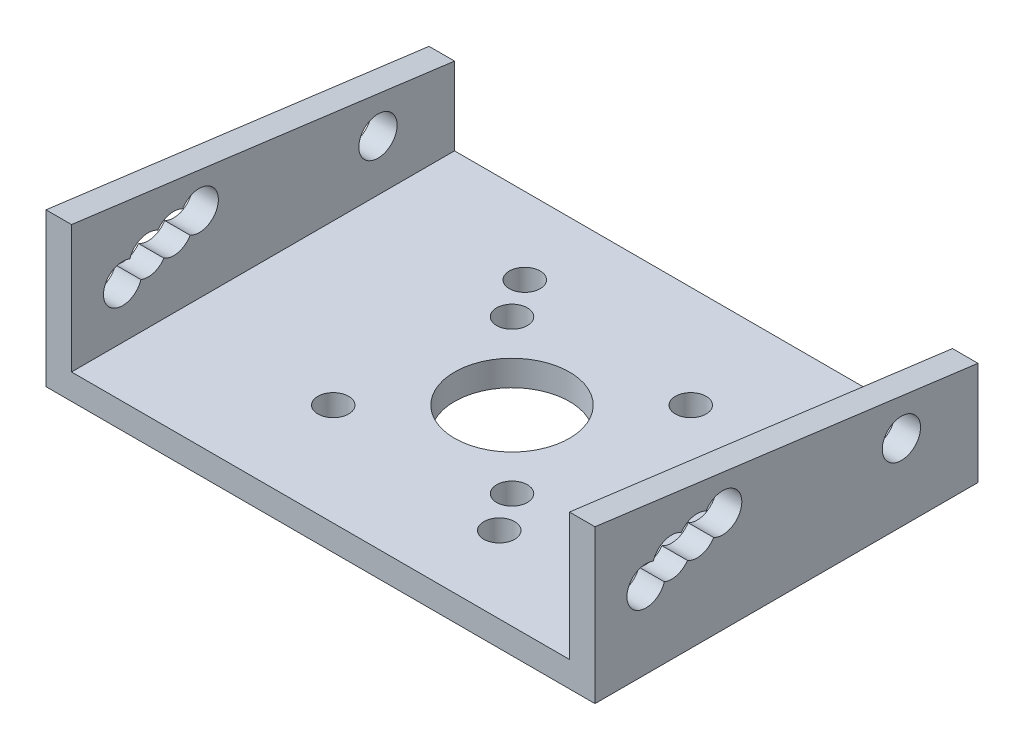
ISO-10303-21;
HEADER;
FILE_DESCRIPTION(('STEP AP214'),'2;1');
FILE_NAME('part.step','',(''),(''),'','','');
FILE_SCHEMA(('AUTOMOTIVE_DESIGN { 1 0 10303 214 1 1 1 1 }'));
ENDSEC;
DATA;
#1=APPLICATION_CONTEXT('core data for automotive mechanical design processes');
#2=APPLICATION_PROTOCOL_DEFINITION('international standard','automotive_design',2000,#1);
#3=PRODUCT_CONTEXT('',#1,'mechanical');
#4=PRODUCT('Part','Part','',(#3));
#5=PRODUCT_RELATED_PRODUCT_CATEGORY('part','',(#4));
#6=PRODUCT_DEFINITION_FORMATION('','',#4);
#7=PRODUCT_DEFINITION_CONTEXT('part definition',#1,'design');
#8=PRODUCT_DEFINITION('design','',#6,#7);
#9=PRODUCT_DEFINITION_SHAPE('','',#8);
#10=(LENGTH_UNIT() NAMED_UNIT(*) SI_UNIT(.MILLI.,.METRE.));
#11=(NAMED_UNIT(*) PLANE_ANGLE_UNIT() SI_UNIT($,.RADIAN.));
#12=(NAMED_UNIT(*) SI_UNIT($,.STERADIAN.) SOLID_ANGLE_UNIT());
#13=UNCERTAINTY_MEASURE_WITH_UNIT(LENGTH_MEASURE(1.E-05),#10,'distance_accuracy_value','');
#14=(GEOMETRIC_REPRESENTATION_CONTEXT(3) GLOBAL_UNCERTAINTY_ASSIGNED_CONTEXT((#13)) GLOBAL_UNIT_ASSIGNED_CONTEXT((#10,
#11,#12)) REPRESENTATION_CONTEXT('',''));
#15=CARTESIAN_POINT('',(0.,0.,0.));
#16=DIRECTION('',(0.,0.,1.));
#17=DIRECTION('',(1.,0.,0.));
#18=AXIS2_PLACEMENT_3D('',#15,#16,#17);
#19=CARTESIAN_POINT('',(0.,2.,0.));
#20=DIRECTION('',(0.,-1.,0.));
#21=DIRECTION('',(0.,0.,-1.));
#22=AXIS2_PLACEMENT_3D('',#19,#20,#21);
#23=PLANE('',#22);
#24=CARTESIAN_POINT('',(6.,2.,6.));
#25=DIRECTION('',(0.,1.,0.));
#26=DIRECTION('',(0.,0.,1.));
#27=AXIS2_PLACEMENT_3D('',#24,#25,#26);
#28=CIRCLE('',#27,1.2058376326813);
#29=CARTESIAN_POINT('',(6.,2.,7.2058376326813));
#30=VERTEX_POINT('',#29);
#31=EDGE_CURVE('E312',#30,#30,#28,.T.);
#32=ORIENTED_EDGE('',*,*,#31,.F.);
#33=EDGE_LOOP('',(#32));
#34=FACE_BOUND('',#33,.T.);
#35=CARTESIAN_POINT('',(-8.,2.,-9.));
#36=DIRECTION('',(0.,1.,0.));
#37=DIRECTION('',(0.,0.,1.));
#38=AXIS2_PLACEMENT_3D('',#35,#36,#37);
#39=CIRCLE('',#38,1.2058376326813);
#40=CARTESIAN_POINT('',(-8.,2.,-7.79416236731869));
#41=VERTEX_POINT('',#40);
#42=EDGE_CURVE('E324',#41,#41,#39,.T.);
#43=ORIENTED_EDGE('',*,*,#42,.F.);
#44=EDGE_LOOP('',(#43));
#45=FACE_BOUND('',#44,.T.);
#46=CARTESIAN_POINT('',(7.,2.,-7.));
#47=DIRECTION('',(0.,1.,0.));
#48=DIRECTION('',(0.,0.,1.));
#49=AXIS2_PLACEMENT_3D('',#46,#47,#48);
#50=CIRCLE('',#49,1.20583763268131);
#51=CARTESIAN_POINT('',(7.,2.,-5.79416236731869));
#52=VERTEX_POINT('',#51);
#53=EDGE_CURVE('E336',#52,#52,#50,.T.);
#54=ORIENTED_EDGE('',*,*,#53,.F.);
#55=EDGE_LOOP('',(#54));
#56=FACE_BOUND('',#55,.T.);
#57=CARTESIAN_POINT('',(0.,2.,0.));
#58=DIRECTION('',(0.,1.,0.));
#59=DIRECTION('',(0.,0.,1.));
#60=AXIS2_PLACEMENT_3D('',#57,#58,#59);
#61=CIRCLE('',#60,4.5);
#62=CARTESIAN_POINT('',(0.,2.,4.5));
#63=VERTEX_POINT('',#62);
#64=EDGE_CURVE('E342',#63,#63,#61,.T.);
#65=ORIENTED_EDGE('',*,*,#64,.F.);
#66=EDGE_LOOP('',(#65));
#67=FACE_BOUND('',#66,.T.);
#68=CARTESIAN_POINT('',(-6.,2.,-6.));
#69=DIRECTION('',(0.,1.,0.));
#70=DIRECTION('',(0.,0.,1.));
#71=AXIS2_PLACEMENT_3D('',#68,#69,#70);
#72=CIRCLE('',#71,1.2058376326813);
#73=CARTESIAN_POINT('',(-6.,2.,-4.7941623673187));
#74=VERTEX_POINT('',#73);
#75=EDGE_CURVE('E330',#74,#74,#72,.T.);
#76=ORIENTED_EDGE('',*,*,#75,.F.);
#77=EDGE_LOOP('',(#76));
#78=FACE_BOUND('',#77,.T.);
#79=CARTESIAN_POINT('',(-7.,2.,7.));
#80=DIRECTION('',(0.,1.,0.));
#81=DIRECTION('',(0.,0.,1.));
#82=AXIS2_PLACEMENT_3D('',#79,#80,#81);
#83=CIRCLE('',#82,1.2058376326813);
#84=CARTESIAN_POINT('',(-7.,2.,8.2058376326813));
#85=VERTEX_POINT('',#84);
#86=EDGE_CURVE('E318',#85,#85,#83,.T.);
#87=ORIENTED_EDGE('',*,*,#86,.F.);
#88=EDGE_LOOP('',(#87));
#89=FACE_BOUND('',#88,.T.);
#90=CARTESIAN_POINT('',(8.,2.,9.));
#91=DIRECTION('',(0.,1.,0.));
#92=DIRECTION('',(0.,0.,1.));
#93=AXIS2_PLACEMENT_3D('',#90,#91,#92);
#94=CIRCLE('',#93,1.20583763268131);
#95=CARTESIAN_POINT('',(8.,2.,10.2058376326813));
#96=VERTEX_POINT('',#95);
#97=EDGE_CURVE('E304',#96,#96,#94,.T.);
#98=ORIENTED_EDGE('',*,*,#97,.F.);
#99=EDGE_LOOP('',(#98));
#100=FACE_BOUND('',#99,.T.);
#101=DIRECTION('',(0.,0.,-1.));
#102=VECTOR('',#101,1.);
#103=CARTESIAN_POINT('',(19.5,2.,0.));
#104=LINE('',#103,#102);
#105=CARTESIAN_POINT('',(19.5,2.,15.));
#106=VERTEX_POINT('',#105);
#107=CARTESIAN_POINT('',(19.5,2.,-15.));
#108=VERTEX_POINT('',#107);
#109=EDGE_CURVE('E56',#106,#108,#104,.T.);
#110=ORIENTED_EDGE('',*,*,#109,.T.);
#111=DIRECTION('',(-1.,0.,0.));
#112=VECTOR('',#111,1.);
#113=CARTESIAN_POINT('',(-21.5,2.,-15.));
#114=LINE('',#113,#112);
#115=CARTESIAN_POINT('',(-19.5,2.,-15.));
#116=VERTEX_POINT('',#115);
#117=EDGE_CURVE('E42',#108,#116,#114,.T.);
#118=ORIENTED_EDGE('',*,*,#117,.T.);
#119=DIRECTION('',(0.,0.,-1.));
#120=VECTOR('',#119,1.);
#121=CARTESIAN_POINT('',(-19.5,2.,0.));
#122=LINE('',#121,#120);
#123=CARTESIAN_POINT('',(-19.5,2.,15.));
#124=VERTEX_POINT('',#123);
#125=EDGE_CURVE('E278',#124,#116,#122,.T.);
#126=ORIENTED_EDGE('',*,*,#125,.F.);
#127=DIRECTION('',(1.,0.,0.));
#128=VECTOR('',#127,1.);
#129=CARTESIAN_POINT('',(-21.5,2.,15.));
#130=LINE('',#129,#128);
#131=EDGE_CURVE('E61',#124,#106,#130,.T.);
#132=ORIENTED_EDGE('',*,*,#131,.T.);
#133=EDGE_LOOP('',(#110,#118,#126,#132));
#134=FACE_BOUND('',#133,.T.);
#135=ADVANCED_FACE('F38',(#34,#45,#56,#67,#78,#89,#100,#134),#23,.F.);
#136=CARTESIAN_POINT('',(0.,0.,0.));
#137=DIRECTION('',(0.,-1.,0.));
#138=DIRECTION('',(0.,0.,-1.));
#139=AXIS2_PLACEMENT_3D('',#136,#137,#138);
#140=PLANE('',#139);
#141=CARTESIAN_POINT('',(6.,0.,6.));
#142=DIRECTION('',(0.,1.,0.));
#143=DIRECTION('',(0.,0.,1.));
#144=AXIS2_PLACEMENT_3D('',#141,#142,#143);
#145=CIRCLE('',#144,1.2058376326813);
#146=CARTESIAN_POINT('',(6.,0.,7.2058376326813));
#147=VERTEX_POINT('',#146);
#148=EDGE_CURVE('E307',#147,#147,#145,.T.);
#149=ORIENTED_EDGE('',*,*,#148,.T.);
#150=EDGE_LOOP('',(#149));
#151=FACE_BOUND('',#150,.T.);
#152=CARTESIAN_POINT('',(-8.,0.,-9.));
#153=DIRECTION('',(0.,1.,0.));
#154=DIRECTION('',(0.,0.,1.));
#155=AXIS2_PLACEMENT_3D('',#152,#153,#154);
#156=CIRCLE('',#155,1.2058376326813);
#157=CARTESIAN_POINT('',(-8.,0.,-7.79416236731869));
#158=VERTEX_POINT('',#157);
#159=EDGE_CURVE('E321',#158,#158,#156,.T.);
#160=ORIENTED_EDGE('',*,*,#159,.T.);
#161=EDGE_LOOP('',(#160));
#162=FACE_BOUND('',#161,.T.);
#163=CARTESIAN_POINT('',(7.,0.,-7.));
#164=DIRECTION('',(0.,1.,0.));
#165=DIRECTION('',(0.,0.,1.));
#166=AXIS2_PLACEMENT_3D('',#163,#164,#165);
#167=CIRCLE('',#166,1.20583763268131);
#168=CARTESIAN_POINT('',(7.,0.,-5.79416236731869));
#169=VERTEX_POINT('',#168);
#170=EDGE_CURVE('E333',#169,#169,#167,.T.);
#171=ORIENTED_EDGE('',*,*,#170,.T.);
#172=EDGE_LOOP('',(#171));
#173=FACE_BOUND('',#172,.T.);
#174=DIRECTION('',(0.,0.,-1.));
#175=VECTOR('',#174,1.);
#176=CARTESIAN_POINT('',(21.5,0.,15.));
#177=LINE('',#176,#175);
#178=CARTESIAN_POINT('',(21.5,0.,15.));
#179=VERTEX_POINT('',#178);
#180=CARTESIAN_POINT('',(21.5,0.,-15.));
#181=VERTEX_POINT('',#180);
#182=EDGE_CURVE('E345',#179,#181,#177,.T.);
#183=ORIENTED_EDGE('',*,*,#182,.F.);
#184=DIRECTION('',(1.,0.,0.));
#185=VECTOR('',#184,1.);
#186=CARTESIAN_POINT('',(-21.5,0.,15.));
#187=LINE('',#186,#185);
#188=CARTESIAN_POINT('',(-21.5,0.,15.));
#189=VERTEX_POINT('',#188);
#190=EDGE_CURVE('E356',#189,#179,#187,.T.);
#191=ORIENTED_EDGE('',*,*,#190,.F.);
#192=DIRECTION('',(0.,0.,1.));
#193=VECTOR('',#192,1.);
#194=CARTESIAN_POINT('',(-21.5,0.,15.));
#195=LINE('',#194,#193);
#196=CARTESIAN_POINT('',(-21.5,0.,-15.));
#197=VERTEX_POINT('',#196);
#198=EDGE_CURVE('E354',#197,#189,#195,.T.);
#199=ORIENTED_EDGE('',*,*,#198,.F.);
#200=DIRECTION('',(-1.,0.,0.));
#201=VECTOR('',#200,1.);
#202=CARTESIAN_POINT('',(-21.5,0.,-15.));
#203=LINE('',#202,#201);
#204=EDGE_CURVE('E352',#181,#197,#203,.T.);
#205=ORIENTED_EDGE('',*,*,#204,.F.);
#206=EDGE_LOOP('',(#183,#191,#199,#205));
#207=FACE_BOUND('',#206,.T.);
#208=CARTESIAN_POINT('',(0.,0.,0.));
#209=DIRECTION('',(0.,1.,0.));
#210=DIRECTION('',(0.,0.,1.));
#211=AXIS2_PLACEMENT_3D('',#208,#209,#210);
#212=CIRCLE('',#211,4.5);
#213=CARTESIAN_POINT('',(0.,0.,4.5));
#214=VERTEX_POINT('',#213);
#215=EDGE_CURVE('E339',#214,#214,#212,.T.);
#216=ORIENTED_EDGE('',*,*,#215,.T.);
#217=EDGE_LOOP('',(#216));
#218=FACE_BOUND('',#217,.T.);
#219=CARTESIAN_POINT('',(-6.,0.,-6.));
#220=DIRECTION('',(0.,1.,0.));
#221=DIRECTION('',(0.,0.,1.));
#222=AXIS2_PLACEMENT_3D('',#219,#220,#221);
#223=CIRCLE('',#222,1.2058376326813);
#224=CARTESIAN_POINT('',(-6.,0.,-4.7941623673187));
#225=VERTEX_POINT('',#224);
#226=EDGE_CURVE('E327',#225,#225,#223,.T.);
#227=ORIENTED_EDGE('',*,*,#226,.T.);
#228=EDGE_LOOP('',(#227));
#229=FACE_BOUND('',#228,.T.);
#230=CARTESIAN_POINT('',(-7.,0.,7.));
#231=DIRECTION('',(0.,1.,0.));
#232=DIRECTION('',(0.,0.,1.));
#233=AXIS2_PLACEMENT_3D('',#230,#231,#232);
#234=CIRCLE('',#233,1.2058376326813);
#235=CARTESIAN_POINT('',(-7.,0.,8.2058376326813));
#236=VERTEX_POINT('',#235);
#237=EDGE_CURVE('E315',#236,#236,#234,.T.);
#238=ORIENTED_EDGE('',*,*,#237,.T.);
#239=EDGE_LOOP('',(#238));
#240=FACE_BOUND('',#239,.T.);
#241=CARTESIAN_POINT('',(8.,0.,9.));
#242=DIRECTION('',(0.,1.,0.));
#243=DIRECTION('',(0.,0.,1.));
#244=AXIS2_PLACEMENT_3D('',#241,#242,#243);
#245=CIRCLE('',#244,1.20583763268131);
#246=CARTESIAN_POINT('',(8.,0.,10.2058376326813));
#247=VERTEX_POINT('',#246);
#248=EDGE_CURVE('E308',#247,#247,#245,.T.);
#249=ORIENTED_EDGE('',*,*,#248,.T.);
#250=EDGE_LOOP('',(#249));
#251=FACE_BOUND('',#250,.T.);
#252=ADVANCED_FACE('F377',(#151,#162,#173,#207,#218,#229,#240,#251),#140,.T.);
#253=CARTESIAN_POINT('',(21.5,2.,15.));
#254=DIRECTION('',(-1.,0.,0.));
#255=DIRECTION('',(0.,0.,1.));
#256=AXIS2_PLACEMENT_3D('',#253,#254,#255);
#257=PLANE('',#256);
#258=ORIENTED_EDGE('',*,*,#182,.T.);
#259=DIRECTION('',(0.,-1.,0.));
#260=VECTOR('',#259,1.);
#261=CARTESIAN_POINT('',(21.5,2.,-15.));
#262=LINE('',#261,#260);
#263=CARTESIAN_POINT('',(21.5,8.08944509942933,-15.));
#264=VERTEX_POINT('',#263);
#265=EDGE_CURVE('E11',#264,#181,#262,.T.);
#266=ORIENTED_EDGE('',*,*,#265,.F.);
#267=DIRECTION('',(0.,0.129258302982044,0.99161095753839));
#268=VECTOR('',#267,1.);
#269=CARTESIAN_POINT('',(21.5,9.87689824947524,-1.28747176173078));
#270=LINE('',#269,#268);
#271=CARTESIAN_POINT('',(21.5,12.,15.));
#272=VERTEX_POINT('',#271);
#273=EDGE_CURVE('E204',#264,#272,#270,.T.);
#274=ORIENTED_EDGE('',*,*,#273,.T.);
#275=DIRECTION('',(0.,-1.,0.));
#276=VECTOR('',#275,1.);
#277=CARTESIAN_POINT('',(21.5,2.,15.));
#278=LINE('',#277,#276);
#279=EDGE_CURVE('E358',#272,#179,#278,.T.);
#280=ORIENTED_EDGE('',*,*,#279,.T.);
#281=EDGE_LOOP('',(#258,#266,#274,#280));
#282=FACE_BOUND('',#281,.T.);
#283=CARTESIAN_POINT('',(21.5,6.,11.));
#284=DIRECTION('',(-1.,0.,0.));
#285=DIRECTION('',(0.,0.,1.));
#286=AXIS2_PLACEMENT_3D('',#283,#284,#285);
#287=CIRCLE('',#286,1.5);
#288=CARTESIAN_POINT('',(21.5,5.55190263226596,9.568494237165));
#289=VERTEX_POINT('',#288);
#290=CARTESIAN_POINT('',(21.5,7.38809736773404,10.431505762835));
#291=VERTEX_POINT('',#290);
#292=EDGE_CURVE('E227',#289,#291,#287,.T.);
#293=ORIENTED_EDGE('',*,*,#292,.T.);
#294=CARTESIAN_POINT('',(21.5,6.94,9.));
#295=DIRECTION('',(-1.,0.,0.));
#296=DIRECTION('',(0.,0.,1.));
#297=AXIS2_PLACEMENT_3D('',#294,#295,#296);
#298=CIRCLE('',#297,1.5);
#299=CARTESIAN_POINT('',(21.5,8.23344859091753,8.24040093295645));
#300=VERTEX_POINT('',#299);
#301=EDGE_CURVE('E181',#291,#300,#298,.T.);
#302=ORIENTED_EDGE('',*,*,#301,.T.);
#303=CARTESIAN_POINT('',(21.5,7.39,7.));
#304=DIRECTION('',(-1.,0.,0.));
#305=DIRECTION('',(0.,0.,1.));
#306=AXIS2_PLACEMENT_3D('',#303,#304,#305);
#307=CIRCLE('',#306,1.5);
#308=CARTESIAN_POINT('',(21.5,8.71231680996912,6.29184870679136));
#309=VERTEX_POINT('',#308);
#310=EDGE_CURVE('E230',#300,#309,#307,.T.);
#311=ORIENTED_EDGE('',*,*,#310,.T.);
#312=CARTESIAN_POINT('',(21.5,7.95,5.));
#313=DIRECTION('',(-1.,0.,0.));
#314=DIRECTION('',(0.,0.,1.));
#315=AXIS2_PLACEMENT_3D('',#312,#313,#314);
#316=CIRCLE('',#315,1.5);
#317=CARTESIAN_POINT('',(21.5,6.62768319003088,5.70815129320865));
#318=VERTEX_POINT('',#317);
#319=EDGE_CURVE('E234',#309,#318,#316,.T.);
#320=ORIENTED_EDGE('',*,*,#319,.T.);
#321=CARTESIAN_POINT('',(21.5,6.09655140908246,7.75959906704356));
#322=VERTEX_POINT('',#321);
#323=EDGE_CURVE('E235',#318,#322,#307,.T.);
#324=ORIENTED_EDGE('',*,*,#323,.T.);
#325=EDGE_CURVE('E231',#322,#289,#298,.T.);
#326=ORIENTED_EDGE('',*,*,#325,.T.);
#327=EDGE_LOOP('',(#293,#302,#311,#320,#324,#326));
#328=FACE_BOUND('',#327,.T.);
#329=CARTESIAN_POINT('',(21.5,6.,-9.));
#330=DIRECTION('',(-1.,0.,0.));
#331=DIRECTION('',(0.,0.,1.));
#332=AXIS2_PLACEMENT_3D('',#329,#330,#331);
#333=CIRCLE('',#332,1.5);
#334=CARTESIAN_POINT('',(21.5,6.,-7.5));
#335=VERTEX_POINT('',#334);
#336=EDGE_CURVE('E207',#335,#335,#333,.T.);
#337=ORIENTED_EDGE('',*,*,#336,.T.);
#338=EDGE_LOOP('',(#337));
#339=FACE_BOUND('',#338,.T.);
#340=ADVANCED_FACE('F40',(#282,#328,#339),#257,.F.);
#341=CARTESIAN_POINT('',(-21.5,2.,-15.));
#342=DIRECTION('',(0.,0.,1.));
#343=DIRECTION('',(1.,0.,0.));
#344=AXIS2_PLACEMENT_3D('',#341,#342,#343);
#345=PLANE('',#344);
#346=ORIENTED_EDGE('',*,*,#204,.T.);
#347=DIRECTION('',(0.,-1.,0.));
#348=VECTOR('',#347,1.);
#349=CARTESIAN_POINT('',(-21.5,2.,-15.));
#350=LINE('',#349,#348);
#351=CARTESIAN_POINT('',(-21.5,8.08944509942933,-15.));
#352=VERTEX_POINT('',#351);
#353=EDGE_CURVE('E48',#352,#197,#350,.T.);
#354=ORIENTED_EDGE('',*,*,#353,.F.);
#355=DIRECTION('',(-1.,0.,0.));
#356=VECTOR('',#355,1.);
#357=CARTESIAN_POINT('',(-19.5,8.08944509942933,-15.));
#358=LINE('',#357,#356);
#359=CARTESIAN_POINT('',(-19.5,8.08944509942933,-15.));
#360=VERTEX_POINT('',#359);
#361=EDGE_CURVE('E396',#360,#352,#358,.T.);
#362=ORIENTED_EDGE('',*,*,#361,.F.);
#363=DIRECTION('',(0.,1.,0.));
#364=VECTOR('',#363,1.);
#365=CARTESIAN_POINT('',(-19.5,0.,-15.));
#366=LINE('',#365,#364);
#367=EDGE_CURVE('E273',#116,#360,#366,.T.);
#368=ORIENTED_EDGE('',*,*,#367,.F.);
#369=ORIENTED_EDGE('',*,*,#117,.F.);
#370=DIRECTION('',(0.,1.,0.));
#371=VECTOR('',#370,1.);
#372=CARTESIAN_POINT('',(19.5,0.,-15.));
#373=LINE('',#372,#371);
#374=CARTESIAN_POINT('',(19.5,8.08944509942933,-15.));
#375=VERTEX_POINT('',#374);
#376=EDGE_CURVE('E187',#108,#375,#373,.T.);
#377=ORIENTED_EDGE('',*,*,#376,.T.);
#378=DIRECTION('',(1.,0.,0.));
#379=VECTOR('',#378,1.);
#380=CARTESIAN_POINT('',(19.5,8.08944509942933,-15.));
#381=LINE('',#380,#379);
#382=EDGE_CURVE('E240',#375,#264,#381,.T.);
#383=ORIENTED_EDGE('',*,*,#382,.T.);
#384=ORIENTED_EDGE('',*,*,#265,.T.);
#385=EDGE_LOOP('',(#346,#354,#362,#368,#369,#377,#383,#384));
#386=FACE_BOUND('',#385,.T.);
#387=ADVANCED_FACE('F391',(#386),#345,.F.);
#388=CARTESIAN_POINT('',(-21.5,2.,15.));
#389=DIRECTION('',(1.,0.,0.));
#390=DIRECTION('',(0.,0.,-1.));
#391=AXIS2_PLACEMENT_3D('',#388,#389,#390);
#392=PLANE('',#391);
#393=ORIENTED_EDGE('',*,*,#198,.T.);
#394=DIRECTION('',(0.,-1.,0.));
#395=VECTOR('',#394,1.);
#396=CARTESIAN_POINT('',(-21.5,2.,15.));
#397=LINE('',#396,#395);
#398=CARTESIAN_POINT('',(-21.5,12.,15.));
#399=VERTEX_POINT('',#398);
#400=EDGE_CURVE('E361',#399,#189,#397,.T.);
#401=ORIENTED_EDGE('',*,*,#400,.F.);
#402=DIRECTION('',(0.,0.129258302982044,0.99161095753839));
#403=VECTOR('',#402,1.);
#404=CARTESIAN_POINT('',(-21.5,9.87689824947524,-1.28747176173078));
#405=LINE('',#404,#403);
#406=EDGE_CURVE('E259',#352,#399,#405,.T.);
#407=ORIENTED_EDGE('',*,*,#406,.F.);
#408=ORIENTED_EDGE('',*,*,#353,.T.);
#409=EDGE_LOOP('',(#393,#401,#407,#408));
#410=FACE_BOUND('',#409,.T.);
#411=CARTESIAN_POINT('',(-21.5,6.,11.));
#412=DIRECTION('',(-1.,0.,0.));
#413=DIRECTION('',(0.,0.,1.));
#414=AXIS2_PLACEMENT_3D('',#411,#412,#413);
#415=CIRCLE('',#414,1.5);
#416=CARTESIAN_POINT('',(-21.5,5.55190263226596,9.568494237165));
#417=VERTEX_POINT('',#416);
#418=CARTESIAN_POINT('',(-21.5,7.38809736773404,10.431505762835));
#419=VERTEX_POINT('',#418);
#420=EDGE_CURVE('E243',#417,#419,#415,.T.);
#421=ORIENTED_EDGE('',*,*,#420,.F.);
#422=CARTESIAN_POINT('',(-21.5,6.94,9.));
#423=DIRECTION('',(-1.,0.,0.));
#424=DIRECTION('',(0.,0.,1.));
#425=AXIS2_PLACEMENT_3D('',#422,#423,#424);
#426=CIRCLE('',#425,1.5);
#427=CARTESIAN_POINT('',(-21.5,6.09655140908246,7.75959906704356));
#428=VERTEX_POINT('',#427);
#429=EDGE_CURVE('E427',#428,#417,#426,.T.);
#430=ORIENTED_EDGE('',*,*,#429,.F.);
#431=CARTESIAN_POINT('',(-21.5,7.39,7.));
#432=DIRECTION('',(-1.,0.,0.));
#433=DIRECTION('',(0.,0.,1.));
#434=AXIS2_PLACEMENT_3D('',#431,#432,#433);
#435=CIRCLE('',#434,1.5);
#436=CARTESIAN_POINT('',(-21.5,6.62768319003088,5.70815129320865));
#437=VERTEX_POINT('',#436);
#438=EDGE_CURVE('E419',#437,#428,#435,.T.);
#439=ORIENTED_EDGE('',*,*,#438,.F.);
#440=CARTESIAN_POINT('',(-21.5,7.95,5.));
#441=DIRECTION('',(-1.,0.,0.));
#442=DIRECTION('',(0.,0.,1.));
#443=AXIS2_PLACEMENT_3D('',#440,#441,#442);
#444=CIRCLE('',#443,1.5);
#445=CARTESIAN_POINT('',(-21.5,8.71231680996912,6.29184870679136));
#446=VERTEX_POINT('',#445);
#447=EDGE_CURVE('E426',#446,#437,#444,.T.);
#448=ORIENTED_EDGE('',*,*,#447,.F.);
#449=CARTESIAN_POINT('',(-21.5,8.23344859091753,8.24040093295645));
#450=VERTEX_POINT('',#449);
#451=EDGE_CURVE('E429',#450,#446,#435,.T.);
#452=ORIENTED_EDGE('',*,*,#451,.F.);
#453=EDGE_CURVE('E431',#419,#450,#426,.T.);
#454=ORIENTED_EDGE('',*,*,#453,.F.);
#455=EDGE_LOOP('',(#421,#430,#439,#448,#452,#454));
#456=FACE_BOUND('',#455,.T.);
#457=CARTESIAN_POINT('',(-21.5,6.,-9.));
#458=DIRECTION('',(-1.,0.,0.));
#459=DIRECTION('',(0.,0.,1.));
#460=AXIS2_PLACEMENT_3D('',#457,#458,#459);
#461=CIRCLE('',#460,1.5);
#462=CARTESIAN_POINT('',(-21.5,6.,-7.5));
#463=VERTEX_POINT('',#462);
#464=EDGE_CURVE('E434',#463,#463,#461,.T.);
#465=ORIENTED_EDGE('',*,*,#464,.F.);
#466=EDGE_LOOP('',(#465));
#467=FACE_BOUND('',#466,.T.);
#468=ADVANCED_FACE('F368',(#410,#456,#467),#392,.F.);
#469=CARTESIAN_POINT('',(-21.5,2.,15.));
#470=DIRECTION('',(0.,0.,-1.));
#471=DIRECTION('',(-1.,0.,0.));
#472=AXIS2_PLACEMENT_3D('',#469,#470,#471);
#473=PLANE('',#472);
#474=ORIENTED_EDGE('',*,*,#190,.T.);
#475=ORIENTED_EDGE('',*,*,#279,.F.);
#476=DIRECTION('',(1.,0.,0.));
#477=VECTOR('',#476,1.);
#478=CARTESIAN_POINT('',(19.5,12.,15.));
#479=LINE('',#478,#477);
#480=CARTESIAN_POINT('',(19.5,12.,15.));
#481=VERTEX_POINT('',#480);
#482=EDGE_CURVE('E244',#481,#272,#479,.T.);
#483=ORIENTED_EDGE('',*,*,#482,.F.);
#484=DIRECTION('',(0.,-1.,0.));
#485=VECTOR('',#484,1.);
#486=CARTESIAN_POINT('',(19.5,0.,15.));
#487=LINE('',#486,#485);
#488=EDGE_CURVE('E221',#481,#106,#487,.T.);
#489=ORIENTED_EDGE('',*,*,#488,.T.);
#490=ORIENTED_EDGE('',*,*,#131,.F.);
#491=DIRECTION('',(0.,-1.,0.));
#492=VECTOR('',#491,1.);
#493=CARTESIAN_POINT('',(-19.5,0.,15.));
#494=LINE('',#493,#492);
#495=CARTESIAN_POINT('',(-19.5,12.,15.));
#496=VERTEX_POINT('',#495);
#497=EDGE_CURVE('E282',#496,#124,#494,.T.);
#498=ORIENTED_EDGE('',*,*,#497,.F.);
#499=DIRECTION('',(-1.,0.,0.));
#500=VECTOR('',#499,1.);
#501=CARTESIAN_POINT('',(-19.5,12.,15.));
#502=LINE('',#501,#500);
#503=EDGE_CURVE('E311',#496,#399,#502,.T.);
#504=ORIENTED_EDGE('',*,*,#503,.T.);
#505=ORIENTED_EDGE('',*,*,#400,.T.);
#506=EDGE_LOOP('',(#474,#475,#483,#489,#490,#498,#504,#505));
#507=FACE_BOUND('',#506,.T.);
#508=ADVANCED_FACE('F380',(#507),#473,.F.);
#509=CARTESIAN_POINT('',(0.,2.,0.));
#510=DIRECTION('',(0.,-1.,0.));
#511=DIRECTION('',(0.,0.,-1.));
#512=AXIS2_PLACEMENT_3D('',#509,#510,#511);
#513=CYLINDRICAL_SURFACE('',#512,4.5);
#514=ORIENTED_EDGE('',*,*,#64,.T.);
#515=EDGE_LOOP('',(#514));
#516=FACE_BOUND('',#515,.T.);
#517=ORIENTED_EDGE('',*,*,#215,.F.);
#518=EDGE_LOOP('',(#517));
#519=FACE_BOUND('',#518,.T.);
#520=ADVANCED_FACE('F447',(#516,#519),#513,.F.);
#521=CARTESIAN_POINT('',(7.,2.,-7.));
#522=DIRECTION('',(0.,-1.,0.));
#523=DIRECTION('',(0.,0.,-1.));
#524=AXIS2_PLACEMENT_3D('',#521,#522,#523);
#525=CYLINDRICAL_SURFACE('',#524,1.20583763268131);
#526=ORIENTED_EDGE('',*,*,#53,.T.);
#527=EDGE_LOOP('',(#526));
#528=FACE_BOUND('',#527,.T.);
#529=ORIENTED_EDGE('',*,*,#170,.F.);
#530=EDGE_LOOP('',(#529));
#531=FACE_BOUND('',#530,.T.);
#532=ADVANCED_FACE('F462',(#528,#531),#525,.F.);
#533=CARTESIAN_POINT('',(-6.,2.,-6.));
#534=DIRECTION('',(0.,-1.,0.));
#535=DIRECTION('',(0.,0.,-1.));
#536=AXIS2_PLACEMENT_3D('',#533,#534,#535);
#537=CYLINDRICAL_SURFACE('',#536,1.2058376326813);
#538=ORIENTED_EDGE('',*,*,#75,.T.);
#539=EDGE_LOOP('',(#538));
#540=FACE_BOUND('',#539,.T.);
#541=ORIENTED_EDGE('',*,*,#226,.F.);
#542=EDGE_LOOP('',(#541));
#543=FACE_BOUND('',#542,.T.);
#544=ADVANCED_FACE('F466',(#540,#543),#537,.F.);
#545=CARTESIAN_POINT('',(-8.,2.,-9.));
#546=DIRECTION('',(0.,-1.,0.));
#547=DIRECTION('',(0.,0.,-1.));
#548=AXIS2_PLACEMENT_3D('',#545,#546,#547);
#549=CYLINDRICAL_SURFACE('',#548,1.2058376326813);
#550=ORIENTED_EDGE('',*,*,#42,.T.);
#551=EDGE_LOOP('',(#550));
#552=FACE_BOUND('',#551,.T.);
#553=ORIENTED_EDGE('',*,*,#159,.F.);
#554=EDGE_LOOP('',(#553));
#555=FACE_BOUND('',#554,.T.);
#556=ADVANCED_FACE('F470',(#552,#555),#549,.F.);
#557=CARTESIAN_POINT('',(-7.,2.,7.));
#558=DIRECTION('',(0.,-1.,0.));
#559=DIRECTION('',(0.,0.,-1.));
#560=AXIS2_PLACEMENT_3D('',#557,#558,#559);
#561=CYLINDRICAL_SURFACE('',#560,1.2058376326813);
#562=ORIENTED_EDGE('',*,*,#86,.T.);
#563=EDGE_LOOP('',(#562));
#564=FACE_BOUND('',#563,.T.);
#565=ORIENTED_EDGE('',*,*,#237,.F.);
#566=EDGE_LOOP('',(#565));
#567=FACE_BOUND('',#566,.T.);
#568=ADVANCED_FACE('F474',(#564,#567),#561,.F.);
#569=CARTESIAN_POINT('',(6.,2.,6.));
#570=DIRECTION('',(0.,-1.,0.));
#571=DIRECTION('',(0.,0.,-1.));
#572=AXIS2_PLACEMENT_3D('',#569,#570,#571);
#573=CYLINDRICAL_SURFACE('',#572,1.2058376326813);
#574=ORIENTED_EDGE('',*,*,#31,.T.);
#575=EDGE_LOOP('',(#574));
#576=FACE_BOUND('',#575,.T.);
#577=ORIENTED_EDGE('',*,*,#148,.F.);
#578=EDGE_LOOP('',(#577));
#579=FACE_BOUND('',#578,.T.);
#580=ADVANCED_FACE('F478',(#576,#579),#573,.F.);
#581=CARTESIAN_POINT('',(8.,2.,9.));
#582=DIRECTION('',(0.,-1.,0.));
#583=DIRECTION('',(0.,0.,-1.));
#584=AXIS2_PLACEMENT_3D('',#581,#582,#583);
#585=CYLINDRICAL_SURFACE('',#584,1.20583763268131);
#586=ORIENTED_EDGE('',*,*,#97,.T.);
#587=EDGE_LOOP('',(#586));
#588=FACE_BOUND('',#587,.T.);
#589=ORIENTED_EDGE('',*,*,#248,.F.);
#590=EDGE_LOOP('',(#589));
#591=FACE_BOUND('',#590,.T.);
#592=ADVANCED_FACE('F482',(#588,#591),#585,.F.);
#593=CARTESIAN_POINT('',(-19.5,9.87689824947524,-1.28747176173078));
#594=DIRECTION('',(0.,-0.99161095753839,0.129258302982044));
#595=DIRECTION('',(0.,-0.129258302982044,-0.99161095753839));
#596=AXIS2_PLACEMENT_3D('',#593,#594,#595);
#597=PLANE('',#596);
#598=ORIENTED_EDGE('',*,*,#406,.T.);
#599=ORIENTED_EDGE('',*,*,#503,.F.);
#600=DIRECTION('',(0.,0.129258302982044,0.99161095753839));
#601=VECTOR('',#600,1.);
#602=CARTESIAN_POINT('',(-19.5,9.87689824947524,-1.28747176173078));
#603=LINE('',#602,#601);
#604=EDGE_CURVE('E270',#360,#496,#603,.T.);
#605=ORIENTED_EDGE('',*,*,#604,.F.);
#606=ORIENTED_EDGE('',*,*,#361,.T.);
#607=EDGE_LOOP('',(#598,#599,#605,#606));
#608=FACE_BOUND('',#607,.T.);
#609=ADVANCED_FACE('F400',(#608),#597,.F.);
#610=CARTESIAN_POINT('',(-19.5,6.,11.));
#611=DIRECTION('',(-1.,0.,0.));
#612=DIRECTION('',(0.,0.,1.));
#613=AXIS2_PLACEMENT_3D('',#610,#611,#612);
#614=CYLINDRICAL_SURFACE('',#613,1.5);
#615=ORIENTED_EDGE('',*,*,#420,.T.);
#616=DIRECTION('',(-1.,0.,0.));
#617=VECTOR('',#616,1.);
#618=CARTESIAN_POINT('',(-19.5,7.38809736773404,10.431505762835));
#619=LINE('',#618,#617);
#620=CARTESIAN_POINT('',(-19.5,7.38809736773404,10.431505762835));
#621=VERTEX_POINT('',#620);
#622=EDGE_CURVE('E398',#621,#419,#619,.T.);
#623=ORIENTED_EDGE('',*,*,#622,.F.);
#624=CARTESIAN_POINT('',(-19.5,6.,11.));
#625=DIRECTION('',(-1.,0.,0.));
#626=DIRECTION('',(0.,0.,1.));
#627=AXIS2_PLACEMENT_3D('',#624,#625,#626);
#628=CIRCLE('',#627,1.5);
#629=CARTESIAN_POINT('',(-19.5,5.55190263226596,9.568494237165));
#630=VERTEX_POINT('',#629);
#631=EDGE_CURVE('E255',#630,#621,#628,.T.);
#632=ORIENTED_EDGE('',*,*,#631,.F.);
#633=DIRECTION('',(-1.,0.,0.));
#634=VECTOR('',#633,1.);
#635=CARTESIAN_POINT('',(-19.5,5.55190263226596,9.568494237165));
#636=LINE('',#635,#634);
#637=EDGE_CURVE('E288',#630,#417,#636,.T.);
#638=ORIENTED_EDGE('',*,*,#637,.T.);
#639=EDGE_LOOP('',(#615,#623,#632,#638));
#640=FACE_BOUND('',#639,.T.);
#641=ADVANCED_FACE('F487',(#640),#614,.F.);
#642=CARTESIAN_POINT('',(-19.5,6.94,9.));
#643=DIRECTION('',(-1.,0.,0.));
#644=DIRECTION('',(0.,0.,1.));
#645=AXIS2_PLACEMENT_3D('',#642,#643,#644);
#646=CYLINDRICAL_SURFACE('',#645,1.5);
#647=ORIENTED_EDGE('',*,*,#453,.T.);
#648=DIRECTION('',(-1.,0.,0.));
#649=VECTOR('',#648,1.);
#650=CARTESIAN_POINT('',(-19.5,8.23344859091753,8.24040093295645));
#651=LINE('',#650,#649);
#652=CARTESIAN_POINT('',(-19.5,8.23344859091753,8.24040093295645));
#653=VERTEX_POINT('',#652);
#654=EDGE_CURVE('E407',#653,#450,#651,.T.);
#655=ORIENTED_EDGE('',*,*,#654,.F.);
#656=CARTESIAN_POINT('',(-19.5,6.94,9.));
#657=DIRECTION('',(-1.,0.,0.));
#658=DIRECTION('',(0.,0.,1.));
#659=AXIS2_PLACEMENT_3D('',#656,#657,#658);
#660=CIRCLE('',#659,1.5);
#661=EDGE_CURVE('E262',#621,#653,#660,.T.);
#662=ORIENTED_EDGE('',*,*,#661,.F.);
#663=ORIENTED_EDGE('',*,*,#622,.T.);
#664=EDGE_LOOP('',(#647,#655,#662,#663));
#665=FACE_BOUND('',#664,.T.);
#666=ADVANCED_FACE('F490',(#665),#646,.F.);
#667=CARTESIAN_POINT('',(-19.5,7.39,7.));
#668=DIRECTION('',(-1.,0.,0.));
#669=DIRECTION('',(0.,0.,1.));
#670=AXIS2_PLACEMENT_3D('',#667,#668,#669);
#671=CYLINDRICAL_SURFACE('',#670,1.5);
#672=ORIENTED_EDGE('',*,*,#451,.T.);
#673=DIRECTION('',(-1.,0.,0.));
#674=VECTOR('',#673,1.);
#675=CARTESIAN_POINT('',(-19.5,8.71231680996912,6.29184870679136));
#676=LINE('',#675,#674);
#677=CARTESIAN_POINT('',(-19.5,8.71231680996912,6.29184870679136));
#678=VERTEX_POINT('',#677);
#679=EDGE_CURVE('E410',#678,#446,#676,.T.);
#680=ORIENTED_EDGE('',*,*,#679,.F.);
#681=CARTESIAN_POINT('',(-19.5,7.39,7.));
#682=DIRECTION('',(-1.,0.,0.));
#683=DIRECTION('',(0.,0.,1.));
#684=AXIS2_PLACEMENT_3D('',#681,#682,#683);
#685=CIRCLE('',#684,1.5);
#686=EDGE_CURVE('E265',#653,#678,#685,.T.);
#687=ORIENTED_EDGE('',*,*,#686,.F.);
#688=ORIENTED_EDGE('',*,*,#654,.T.);
#689=EDGE_LOOP('',(#672,#680,#687,#688));
#690=FACE_BOUND('',#689,.T.);
#691=ADVANCED_FACE('F494',(#690),#671,.F.);
#692=CARTESIAN_POINT('',(-19.5,7.95,5.));
#693=DIRECTION('',(-1.,0.,0.));
#694=DIRECTION('',(0.,0.,1.));
#695=AXIS2_PLACEMENT_3D('',#692,#693,#694);
#696=CYLINDRICAL_SURFACE('',#695,1.5);
#697=ORIENTED_EDGE('',*,*,#447,.T.);
#698=DIRECTION('',(-1.,0.,0.));
#699=VECTOR('',#698,1.);
#700=CARTESIAN_POINT('',(-19.5,6.62768319003088,5.70815129320865));
#701=LINE('',#700,#699);
#702=CARTESIAN_POINT('',(-19.5,6.62768319003088,5.70815129320865));
#703=VERTEX_POINT('',#702);
#704=EDGE_CURVE('E300',#703,#437,#701,.T.);
#705=ORIENTED_EDGE('',*,*,#704,.F.);
#706=CARTESIAN_POINT('',(-19.5,7.95,5.));
#707=DIRECTION('',(-1.,0.,0.));
#708=DIRECTION('',(0.,0.,1.));
#709=AXIS2_PLACEMENT_3D('',#706,#707,#708);
#710=CIRCLE('',#709,1.5);
#711=EDGE_CURVE('E264',#678,#703,#710,.T.);
#712=ORIENTED_EDGE('',*,*,#711,.F.);
#713=ORIENTED_EDGE('',*,*,#679,.T.);
#714=EDGE_LOOP('',(#697,#705,#712,#713));
#715=FACE_BOUND('',#714,.T.);
#716=ADVANCED_FACE('F491',(#715),#696,.F.);
#717=ORIENTED_EDGE('',*,*,#438,.T.);
#718=DIRECTION('',(-1.,0.,0.));
#719=VECTOR('',#718,1.);
#720=CARTESIAN_POINT('',(-19.5,6.09655140908246,7.75959906704356));
#721=LINE('',#720,#719);
#722=CARTESIAN_POINT('',(-19.5,6.09655140908246,7.75959906704356));
#723=VERTEX_POINT('',#722);
#724=EDGE_CURVE('E292',#723,#428,#721,.T.);
#725=ORIENTED_EDGE('',*,*,#724,.F.);
#726=EDGE_CURVE('E261',#703,#723,#685,.T.);
#727=ORIENTED_EDGE('',*,*,#726,.F.);
#728=ORIENTED_EDGE('',*,*,#704,.T.);
#729=EDGE_LOOP('',(#717,#725,#727,#728));
#730=FACE_BOUND('',#729,.T.);
#731=ADVANCED_FACE('F417',(#730),#671,.F.);
#732=CARTESIAN_POINT('',(-19.5,6.,-9.));
#733=DIRECTION('',(-1.,0.,0.));
#734=DIRECTION('',(0.,0.,1.));
#735=AXIS2_PLACEMENT_3D('',#732,#733,#734);
#736=CYLINDRICAL_SURFACE('',#735,1.5);
#737=CARTESIAN_POINT('',(-19.5,6.,-9.));
#738=DIRECTION('',(-1.,0.,0.));
#739=DIRECTION('',(0.,0.,1.));
#740=AXIS2_PLACEMENT_3D('',#737,#738,#739);
#741=CIRCLE('',#740,1.5);
#742=CARTESIAN_POINT('',(-19.5,6.,-7.5));
#743=VERTEX_POINT('',#742);
#744=EDGE_CURVE('E267',#743,#743,#741,.T.);
#745=ORIENTED_EDGE('',*,*,#744,.F.);
#746=EDGE_LOOP('',(#745));
#747=FACE_BOUND('',#746,.T.);
#748=ORIENTED_EDGE('',*,*,#464,.T.);
#749=EDGE_LOOP('',(#748));
#750=FACE_BOUND('',#749,.T.);
#751=ADVANCED_FACE('F440',(#747,#750),#736,.F.);
#752=ORIENTED_EDGE('',*,*,#429,.T.);
#753=ORIENTED_EDGE('',*,*,#637,.F.);
#754=EDGE_CURVE('E258',#723,#630,#660,.T.);
#755=ORIENTED_EDGE('',*,*,#754,.F.);
#756=ORIENTED_EDGE('',*,*,#724,.T.);
#757=EDGE_LOOP('',(#752,#753,#755,#756));
#758=FACE_BOUND('',#757,.T.);
#759=ADVANCED_FACE('F499',(#758),#646,.F.);
#760=CARTESIAN_POINT('',(-19.5,0.,0.));
#761=DIRECTION('',(-1.,0.,0.));
#762=DIRECTION('',(0.,0.,1.));
#763=AXIS2_PLACEMENT_3D('',#760,#761,#762);
#764=PLANE('',#763);
#765=ORIENTED_EDGE('',*,*,#631,.T.);
#766=ORIENTED_EDGE('',*,*,#661,.T.);
#767=ORIENTED_EDGE('',*,*,#686,.T.);
#768=ORIENTED_EDGE('',*,*,#711,.T.);
#769=ORIENTED_EDGE('',*,*,#726,.T.);
#770=ORIENTED_EDGE('',*,*,#754,.T.);
#771=EDGE_LOOP('',(#765,#766,#767,#768,#769,#770));
#772=FACE_BOUND('',#771,.T.);
#773=ORIENTED_EDGE('',*,*,#744,.T.);
#774=EDGE_LOOP('',(#773));
#775=FACE_BOUND('',#774,.T.);
#776=ORIENTED_EDGE('',*,*,#604,.T.);
#777=ORIENTED_EDGE('',*,*,#497,.T.);
#778=ORIENTED_EDGE('',*,*,#125,.T.);
#779=ORIENTED_EDGE('',*,*,#367,.T.);
#780=EDGE_LOOP('',(#776,#777,#778,#779));
#781=FACE_BOUND('',#780,.T.);
#782=ADVANCED_FACE('F393',(#772,#775,#781),#764,.F.);
#783=CARTESIAN_POINT('',(19.5,9.87689824947524,-1.28747176173078));
#784=DIRECTION('',(0.,0.99161095753839,-0.129258302982044));
#785=DIRECTION('',(0.,0.129258302982044,0.99161095753839));
#786=AXIS2_PLACEMENT_3D('',#783,#784,#785);
#787=PLANE('',#786);
#788=ORIENTED_EDGE('',*,*,#273,.F.);
#789=ORIENTED_EDGE('',*,*,#382,.F.);
#790=DIRECTION('',(0.,0.129258302982044,0.99161095753839));
#791=VECTOR('',#790,1.);
#792=CARTESIAN_POINT('',(19.5,9.87689824947524,-1.28747176173078));
#793=LINE('',#792,#791);
#794=EDGE_CURVE('E218',#375,#481,#793,.T.);
#795=ORIENTED_EDGE('',*,*,#794,.T.);
#796=ORIENTED_EDGE('',*,*,#482,.T.);
#797=EDGE_LOOP('',(#788,#789,#795,#796));
#798=FACE_BOUND('',#797,.T.);
#799=ADVANCED_FACE('F386',(#798),#787,.T.);
#800=CARTESIAN_POINT('',(19.5,6.,11.));
#801=DIRECTION('',(1.,0.,0.));
#802=DIRECTION('',(0.,0.,-1.));
#803=AXIS2_PLACEMENT_3D('',#800,#801,#802);
#804=CYLINDRICAL_SURFACE('',#803,1.5);
#805=ORIENTED_EDGE('',*,*,#292,.F.);
#806=DIRECTION('',(1.,0.,0.));
#807=VECTOR('',#806,1.);
#808=CARTESIAN_POINT('',(19.5,5.55190263226596,9.568494237165));
#809=LINE('',#808,#807);
#810=CARTESIAN_POINT('',(19.5,5.55190263226596,9.568494237165));
#811=VERTEX_POINT('',#810);
#812=EDGE_CURVE('E203',#811,#289,#809,.T.);
#813=ORIENTED_EDGE('',*,*,#812,.F.);
#814=CARTESIAN_POINT('',(19.5,6.,11.));
#815=DIRECTION('',(-1.,0.,0.));
#816=DIRECTION('',(0.,0.,1.));
#817=AXIS2_PLACEMENT_3D('',#814,#815,#816);
#818=CIRCLE('',#817,1.5);
#819=CARTESIAN_POINT('',(19.5,7.38809736773404,10.431505762835));
#820=VERTEX_POINT('',#819);
#821=EDGE_CURVE('E195',#811,#820,#818,.T.);
#822=ORIENTED_EDGE('',*,*,#821,.T.);
#823=DIRECTION('',(1.,0.,0.));
#824=VECTOR('',#823,1.);
#825=CARTESIAN_POINT('',(19.5,7.38809736773404,10.431505762835));
#826=LINE('',#825,#824);
#827=EDGE_CURVE('E176',#820,#291,#826,.T.);
#828=ORIENTED_EDGE('',*,*,#827,.T.);
#829=EDGE_LOOP('',(#805,#813,#822,#828));
#830=FACE_BOUND('',#829,.T.);
#831=ADVANCED_FACE('F202',(#830),#804,.F.);
#832=CARTESIAN_POINT('',(19.5,6.94,9.));
#833=DIRECTION('',(1.,0.,0.));
#834=DIRECTION('',(0.,0.,-1.));
#835=AXIS2_PLACEMENT_3D('',#832,#833,#834);
#836=CYLINDRICAL_SURFACE('',#835,1.5);
#837=ORIENTED_EDGE('',*,*,#325,.F.);
#838=DIRECTION('',(1.,0.,0.));
#839=VECTOR('',#838,1.);
#840=CARTESIAN_POINT('',(19.5,6.09655140908246,7.75959906704356));
#841=LINE('',#840,#839);
#842=CARTESIAN_POINT('',(19.5,6.09655140908246,7.75959906704356));
#843=VERTEX_POINT('',#842);
#844=EDGE_CURVE('E248',#843,#322,#841,.T.);
#845=ORIENTED_EDGE('',*,*,#844,.F.);
#846=CARTESIAN_POINT('',(19.5,6.94,9.));
#847=DIRECTION('',(-1.,0.,0.));
#848=DIRECTION('',(0.,0.,1.));
#849=AXIS2_PLACEMENT_3D('',#846,#847,#848);
#850=CIRCLE('',#849,1.5);
#851=EDGE_CURVE('E201',#843,#811,#850,.T.);
#852=ORIENTED_EDGE('',*,*,#851,.T.);
#853=ORIENTED_EDGE('',*,*,#812,.T.);
#854=EDGE_LOOP('',(#837,#845,#852,#853));
#855=FACE_BOUND('',#854,.T.);
#856=ADVANCED_FACE('F510',(#855),#836,.F.);
#857=CARTESIAN_POINT('',(19.5,7.39,7.));
#858=DIRECTION('',(1.,0.,0.));
#859=DIRECTION('',(0.,0.,-1.));
#860=AXIS2_PLACEMENT_3D('',#857,#858,#859);
#861=CYLINDRICAL_SURFACE('',#860,1.5);
#862=ORIENTED_EDGE('',*,*,#323,.F.);
#863=DIRECTION('',(1.,0.,0.));
#864=VECTOR('',#863,1.);
#865=CARTESIAN_POINT('',(19.5,6.62768319003088,5.70815129320865));
#866=LINE('',#865,#864);
#867=CARTESIAN_POINT('',(19.5,6.62768319003088,5.70815129320865));
#868=VERTEX_POINT('',#867);
#869=EDGE_CURVE('E250',#868,#318,#866,.T.);
#870=ORIENTED_EDGE('',*,*,#869,.F.);
#871=CARTESIAN_POINT('',(19.5,7.39,7.));
#872=DIRECTION('',(-1.,0.,0.));
#873=DIRECTION('',(0.,0.,1.));
#874=AXIS2_PLACEMENT_3D('',#871,#872,#873);
#875=CIRCLE('',#874,1.5);
#876=EDGE_CURVE('E212',#868,#843,#875,.T.);
#877=ORIENTED_EDGE('',*,*,#876,.T.);
#878=ORIENTED_EDGE('',*,*,#844,.T.);
#879=EDGE_LOOP('',(#862,#870,#877,#878));
#880=FACE_BOUND('',#879,.T.);
#881=ADVANCED_FACE('F515',(#880),#861,.F.);
#882=CARTESIAN_POINT('',(19.5,7.95,5.));
#883=DIRECTION('',(1.,0.,0.));
#884=DIRECTION('',(0.,0.,-1.));
#885=AXIS2_PLACEMENT_3D('',#882,#883,#884);
#886=CYLINDRICAL_SURFACE('',#885,1.5);
#887=ORIENTED_EDGE('',*,*,#319,.F.);
#888=DIRECTION('',(1.,0.,0.));
#889=VECTOR('',#888,1.);
#890=CARTESIAN_POINT('',(19.5,8.71231680996912,6.29184870679136));
#891=LINE('',#890,#889);
#892=CARTESIAN_POINT('',(19.5,8.71231680996912,6.29184870679136));
#893=VERTEX_POINT('',#892);
#894=EDGE_CURVE('E252',#893,#309,#891,.T.);
#895=ORIENTED_EDGE('',*,*,#894,.F.);
#896=CARTESIAN_POINT('',(19.5,7.95,5.));
#897=DIRECTION('',(-1.,0.,0.));
#898=DIRECTION('',(0.,0.,1.));
#899=AXIS2_PLACEMENT_3D('',#896,#897,#898);
#900=CIRCLE('',#899,1.5);
#901=EDGE_CURVE('E211',#893,#868,#900,.T.);
#902=ORIENTED_EDGE('',*,*,#901,.T.);
#903=ORIENTED_EDGE('',*,*,#869,.T.);
#904=EDGE_LOOP('',(#887,#895,#902,#903));
#905=FACE_BOUND('',#904,.T.);
#906=ADVANCED_FACE('F511',(#905),#886,.F.);
#907=ORIENTED_EDGE('',*,*,#310,.F.);
#908=DIRECTION('',(1.,0.,0.));
#909=VECTOR('',#908,1.);
#910=CARTESIAN_POINT('',(19.5,8.23344859091753,8.24040093295645));
#911=LINE('',#910,#909);
#912=CARTESIAN_POINT('',(19.5,8.23344859091753,8.24040093295645));
#913=VERTEX_POINT('',#912);
#914=EDGE_CURVE('E186',#913,#300,#911,.T.);
#915=ORIENTED_EDGE('',*,*,#914,.F.);
#916=EDGE_CURVE('E199',#913,#893,#875,.T.);
#917=ORIENTED_EDGE('',*,*,#916,.T.);
#918=ORIENTED_EDGE('',*,*,#894,.T.);
#919=EDGE_LOOP('',(#907,#915,#917,#918));
#920=FACE_BOUND('',#919,.T.);
#921=ADVANCED_FACE('F514',(#920),#861,.F.);
#922=CARTESIAN_POINT('',(19.5,6.,-9.));
#923=DIRECTION('',(1.,0.,0.));
#924=DIRECTION('',(0.,0.,-1.));
#925=AXIS2_PLACEMENT_3D('',#922,#923,#924);
#926=CYLINDRICAL_SURFACE('',#925,1.5);
#927=CARTESIAN_POINT('',(19.5,6.,-9.));
#928=DIRECTION('',(-1.,0.,0.));
#929=DIRECTION('',(0.,0.,1.));
#930=AXIS2_PLACEMENT_3D('',#927,#928,#929);
#931=CIRCLE('',#930,1.5);
#932=CARTESIAN_POINT('',(19.5,6.,-7.5));
#933=VERTEX_POINT('',#932);
#934=EDGE_CURVE('E215',#933,#933,#931,.T.);
#935=ORIENTED_EDGE('',*,*,#934,.T.);
#936=EDGE_LOOP('',(#935));
#937=FACE_BOUND('',#936,.T.);
#938=ORIENTED_EDGE('',*,*,#336,.F.);
#939=EDGE_LOOP('',(#938));
#940=FACE_BOUND('',#939,.T.);
#941=ADVANCED_FACE('F523',(#937,#940),#926,.F.);
#942=ORIENTED_EDGE('',*,*,#301,.F.);
#943=ORIENTED_EDGE('',*,*,#827,.F.);
#944=EDGE_CURVE('E179',#820,#913,#850,.T.);
#945=ORIENTED_EDGE('',*,*,#944,.T.);
#946=ORIENTED_EDGE('',*,*,#914,.T.);
#947=EDGE_LOOP('',(#942,#943,#945,#946));
#948=FACE_BOUND('',#947,.T.);
#949=ADVANCED_FACE('F178',(#948),#836,.F.);
#950=CARTESIAN_POINT('',(19.5,0.,0.));
#951=DIRECTION('',(1.,0.,0.));
#952=DIRECTION('',(0.,0.,1.));
#953=AXIS2_PLACEMENT_3D('',#950,#951,#952);
#954=PLANE('',#953);
#955=ORIENTED_EDGE('',*,*,#821,.F.);
#956=ORIENTED_EDGE('',*,*,#851,.F.);
#957=ORIENTED_EDGE('',*,*,#876,.F.);
#958=ORIENTED_EDGE('',*,*,#901,.F.);
#959=ORIENTED_EDGE('',*,*,#916,.F.);
#960=ORIENTED_EDGE('',*,*,#944,.F.);
#961=EDGE_LOOP('',(#955,#956,#957,#958,#959,#960));
#962=FACE_BOUND('',#961,.T.);
#963=ORIENTED_EDGE('',*,*,#934,.F.);
#964=EDGE_LOOP('',(#963));
#965=FACE_BOUND('',#964,.T.);
#966=ORIENTED_EDGE('',*,*,#794,.F.);
#967=ORIENTED_EDGE('',*,*,#376,.F.);
#968=ORIENTED_EDGE('',*,*,#109,.F.);
#969=ORIENTED_EDGE('',*,*,#488,.F.);
#970=EDGE_LOOP('',(#966,#967,#968,#969));
#971=FACE_BOUND('',#970,.T.);
#972=ADVANCED_FACE('F192',(#962,#965,#971),#954,.F.);
#973=CLOSED_SHELL('',(#135,#252,#340,#387,#468,#508,#520,#532,#544,#556,#568,#580,#592,#609,
#641,#666,#691,#716,#731,#751,#759,#782,#799,#831,#856,#881,#906,#921,#941,#949,#972));
#974=MANIFOLD_SOLID_BREP('B2',#973);
#975=ADVANCED_BREP_SHAPE_REPRESENTATION('',(#18,#974),#14);
#976=SHAPE_DEFINITION_REPRESENTATION(#9,#975);
ENDSEC;
END-ISO-10303-21;
